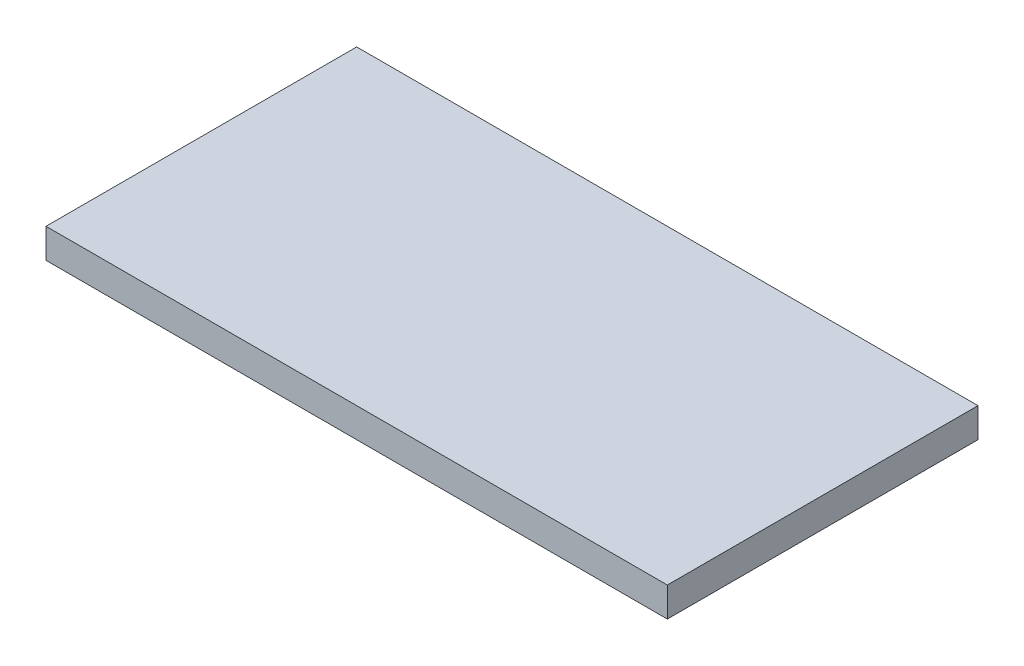
ISO-10303-21;
HEADER;
FILE_DESCRIPTION(('STEP AP214'),'2;1');
FILE_NAME('part.step','',(''),(''),'','','');
FILE_SCHEMA(('AUTOMOTIVE_DESIGN { 1 0 10303 214 1 1 1 1 }'));
ENDSEC;
DATA;
#1=APPLICATION_CONTEXT('core data for automotive mechanical design processes');
#2=APPLICATION_PROTOCOL_DEFINITION('international standard','automotive_design',2000,#1);
#3=PRODUCT_CONTEXT('',#1,'mechanical');
#4=PRODUCT('Part','Part','',(#3));
#5=PRODUCT_RELATED_PRODUCT_CATEGORY('part','',(#4));
#6=PRODUCT_DEFINITION_FORMATION('','',#4);
#7=PRODUCT_DEFINITION_CONTEXT('part definition',#1,'design');
#8=PRODUCT_DEFINITION('design','',#6,#7);
#9=PRODUCT_DEFINITION_SHAPE('','',#8);
#10=(LENGTH_UNIT() NAMED_UNIT(*) SI_UNIT(.MILLI.,.METRE.));
#11=(NAMED_UNIT(*) PLANE_ANGLE_UNIT() SI_UNIT($,.RADIAN.));
#12=(NAMED_UNIT(*) SI_UNIT($,.STERADIAN.) SOLID_ANGLE_UNIT());
#13=UNCERTAINTY_MEASURE_WITH_UNIT(LENGTH_MEASURE(1.E-05),#10,'distance_accuracy_value','');
#14=(GEOMETRIC_REPRESENTATION_CONTEXT(3) GLOBAL_UNCERTAINTY_ASSIGNED_CONTEXT((#13)) GLOBAL_UNIT_ASSIGNED_CONTEXT((#10,
#11,#12)) REPRESENTATION_CONTEXT('',''));
#15=CARTESIAN_POINT('',(0.,0.,0.));
#16=DIRECTION('',(0.,0.,1.));
#17=DIRECTION('',(1.,0.,0.));
#18=AXIS2_PLACEMENT_3D('',#15,#16,#17);
#19=CARTESIAN_POINT('',(0.,19.,0.));
#20=DIRECTION('',(1.,0.,0.));
#21=DIRECTION('',(0.,0.,-1.));
#22=AXIS2_PLACEMENT_3D('',#19,#20,#21);
#23=PLANE('',#22);
#24=DIRECTION('',(0.,0.,1.));
#25=VECTOR('',#24,1.);
#26=CARTESIAN_POINT('',(0.,0.,0.));
#27=LINE('',#26,#25);
#28=CARTESIAN_POINT('',(-1.11022302462516E-13,0.,-200.));
#29=VERTEX_POINT('',#28);
#30=CARTESIAN_POINT('',(0.,0.,0.));
#31=VERTEX_POINT('',#30);
#32=EDGE_CURVE('E97',#29,#31,#27,.T.);
#33=ORIENTED_EDGE('',*,*,#32,.T.);
#34=DIRECTION('',(0.,-1.,0.));
#35=VECTOR('',#34,1.);
#36=CARTESIAN_POINT('',(0.,19.,0.));
#37=LINE('',#36,#35);
#38=CARTESIAN_POINT('',(0.,19.,0.));
#39=VERTEX_POINT('',#38);
#40=EDGE_CURVE('E11',#39,#31,#37,.T.);
#41=ORIENTED_EDGE('',*,*,#40,.F.);
#42=DIRECTION('',(0.,0.,1.));
#43=VECTOR('',#42,1.);
#44=CARTESIAN_POINT('',(0.,19.,0.));
#45=LINE('',#44,#43);
#46=CARTESIAN_POINT('',(-1.11022302462516E-13,19.,-200.));
#47=VERTEX_POINT('',#46);
#48=EDGE_CURVE('E85',#47,#39,#45,.T.);
#49=ORIENTED_EDGE('',*,*,#48,.F.);
#50=DIRECTION('',(0.,-1.,0.));
#51=VECTOR('',#50,1.);
#52=CARTESIAN_POINT('',(-1.11022302462516E-13,19.,-200.));
#53=LINE('',#52,#51);
#54=EDGE_CURVE('E93',#47,#29,#53,.T.);
#55=ORIENTED_EDGE('',*,*,#54,.T.);
#56=EDGE_LOOP('',(#33,#41,#49,#55));
#57=FACE_BOUND('',#56,.T.);
#58=ADVANCED_FACE('F34',(#57),#23,.F.);
#59=CARTESIAN_POINT('',(0.,19.,0.));
#60=DIRECTION('',(0.,0.,-1.));
#61=DIRECTION('',(-1.,0.,0.));
#62=AXIS2_PLACEMENT_3D('',#59,#60,#61);
#63=PLANE('',#62);
#64=DIRECTION('',(1.,0.,0.));
#65=VECTOR('',#64,1.);
#66=CARTESIAN_POINT('',(0.,0.,0.));
#67=LINE('',#66,#65);
#68=CARTESIAN_POINT('',(400.,0.,0.));
#69=VERTEX_POINT('',#68);
#70=EDGE_CURVE('E89',#31,#69,#67,.T.);
#71=ORIENTED_EDGE('',*,*,#70,.T.);
#72=DIRECTION('',(0.,-1.,0.));
#73=VECTOR('',#72,1.);
#74=CARTESIAN_POINT('',(400.,19.,0.));
#75=LINE('',#74,#73);
#76=CARTESIAN_POINT('',(400.,19.,0.));
#77=VERTEX_POINT('',#76);
#78=EDGE_CURVE('E42',#77,#69,#75,.T.);
#79=ORIENTED_EDGE('',*,*,#78,.F.);
#80=DIRECTION('',(1.,0.,0.));
#81=VECTOR('',#80,1.);
#82=CARTESIAN_POINT('',(0.,19.,0.));
#83=LINE('',#82,#81);
#84=EDGE_CURVE('E80',#39,#77,#83,.T.);
#85=ORIENTED_EDGE('',*,*,#84,.F.);
#86=ORIENTED_EDGE('',*,*,#40,.T.);
#87=EDGE_LOOP('',(#71,#79,#85,#86));
#88=FACE_BOUND('',#87,.T.);
#89=ADVANCED_FACE('F88',(#88),#63,.F.);
#90=CARTESIAN_POINT('',(400.,19.,0.));
#91=DIRECTION('',(-1.,0.,0.));
#92=DIRECTION('',(0.,0.,1.));
#93=AXIS2_PLACEMENT_3D('',#90,#91,#92);
#94=PLANE('',#93);
#95=DIRECTION('',(0.,0.,-1.));
#96=VECTOR('',#95,1.);
#97=CARTESIAN_POINT('',(400.,0.,0.));
#98=LINE('',#97,#96);
#99=CARTESIAN_POINT('',(400.,0.,-200.));
#100=VERTEX_POINT('',#99);
#101=EDGE_CURVE('E67',#69,#100,#98,.T.);
#102=ORIENTED_EDGE('',*,*,#101,.T.);
#103=DIRECTION('',(0.,-1.,0.));
#104=VECTOR('',#103,1.);
#105=CARTESIAN_POINT('',(400.,19.,-200.));
#106=LINE('',#105,#104);
#107=CARTESIAN_POINT('',(400.,19.,-200.));
#108=VERTEX_POINT('',#107);
#109=EDGE_CURVE('E90',#108,#100,#106,.T.);
#110=ORIENTED_EDGE('',*,*,#109,.F.);
#111=DIRECTION('',(0.,0.,-1.));
#112=VECTOR('',#111,1.);
#113=CARTESIAN_POINT('',(400.,19.,0.));
#114=LINE('',#113,#112);
#115=EDGE_CURVE('E83',#77,#108,#114,.T.);
#116=ORIENTED_EDGE('',*,*,#115,.F.);
#117=ORIENTED_EDGE('',*,*,#78,.T.);
#118=EDGE_LOOP('',(#102,#110,#116,#117));
#119=FACE_BOUND('',#118,.T.);
#120=ADVANCED_FACE('F91',(#119),#94,.F.);
#121=CARTESIAN_POINT('',(-1.11022302462516E-13,19.,-200.));
#122=DIRECTION('',(0.,0.,1.));
#123=DIRECTION('',(1.,0.,0.));
#124=AXIS2_PLACEMENT_3D('',#121,#122,#123);
#125=PLANE('',#124);
#126=DIRECTION('',(-1.,0.,0.));
#127=VECTOR('',#126,1.);
#128=CARTESIAN_POINT('',(-1.11022302462516E-13,0.,-200.));
#129=LINE('',#128,#127);
#130=EDGE_CURVE('E73',#100,#29,#129,.T.);
#131=ORIENTED_EDGE('',*,*,#130,.T.);
#132=ORIENTED_EDGE('',*,*,#54,.F.);
#133=DIRECTION('',(-1.,0.,0.));
#134=VECTOR('',#133,1.);
#135=CARTESIAN_POINT('',(-1.11022302462516E-13,19.,-200.));
#136=LINE('',#135,#134);
#137=EDGE_CURVE('E50',#108,#47,#136,.T.);
#138=ORIENTED_EDGE('',*,*,#137,.F.);
#139=ORIENTED_EDGE('',*,*,#109,.T.);
#140=EDGE_LOOP('',(#131,#132,#138,#139));
#141=FACE_BOUND('',#140,.T.);
#142=ADVANCED_FACE('F104',(#141),#125,.F.);
#143=CARTESIAN_POINT('',(0.,19.,0.));
#144=DIRECTION('',(0.,-1.,0.));
#145=DIRECTION('',(0.,0.,-1.));
#146=AXIS2_PLACEMENT_3D('',#143,#144,#145);
#147=PLANE('',#146);
#148=ORIENTED_EDGE('',*,*,#48,.T.);
#149=ORIENTED_EDGE('',*,*,#84,.T.);
#150=ORIENTED_EDGE('',*,*,#115,.T.);
#151=ORIENTED_EDGE('',*,*,#137,.T.);
#152=EDGE_LOOP('',(#148,#149,#150,#151));
#153=FACE_BOUND('',#152,.T.);
#154=ADVANCED_FACE('F81',(#153),#147,.F.);
#155=CARTESIAN_POINT('',(0.,0.,0.));
#156=DIRECTION('',(0.,-1.,0.));
#157=DIRECTION('',(0.,0.,-1.));
#158=AXIS2_PLACEMENT_3D('',#155,#156,#157);
#159=PLANE('',#158);
#160=ORIENTED_EDGE('',*,*,#32,.F.);
#161=ORIENTED_EDGE('',*,*,#130,.F.);
#162=ORIENTED_EDGE('',*,*,#101,.F.);
#163=ORIENTED_EDGE('',*,*,#70,.F.);
#164=EDGE_LOOP('',(#160,#161,#162,#163));
#165=FACE_BOUND('',#164,.T.);
#166=ADVANCED_FACE('F107',(#165),#159,.T.);
#167=CLOSED_SHELL('',(#58,#89,#120,#142,#154,#166));
#168=MANIFOLD_SOLID_BREP('B2',#167);
#169=ADVANCED_BREP_SHAPE_REPRESENTATION('',(#18,#168),#14);
#170=SHAPE_DEFINITION_REPRESENTATION(#9,#169);
ENDSEC;
END-ISO-10303-21;
